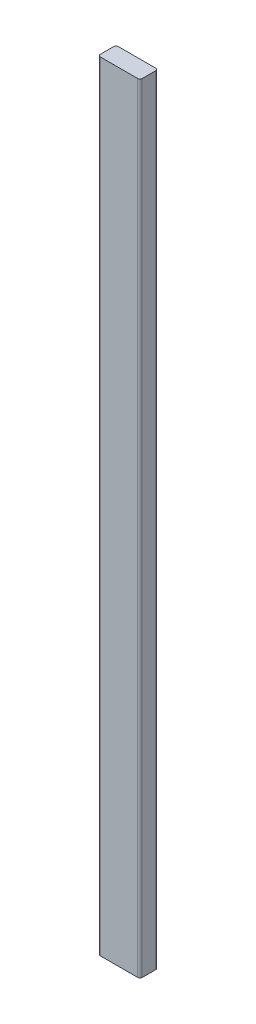
ISO-10303-21;
HEADER;
FILE_DESCRIPTION(('STEP AP214'),'2;1');
FILE_NAME('part.step','',(''),(''),'','','');
FILE_SCHEMA(('AUTOMOTIVE_DESIGN { 1 0 10303 214 1 1 1 1 }'));
ENDSEC;
DATA;
#1=APPLICATION_CONTEXT('core data for automotive mechanical design processes');
#2=APPLICATION_PROTOCOL_DEFINITION('international standard','automotive_design',2000,#1);
#3=PRODUCT_CONTEXT('',#1,'mechanical');
#4=PRODUCT('Part','Part','',(#3));
#5=PRODUCT_RELATED_PRODUCT_CATEGORY('part','',(#4));
#6=PRODUCT_DEFINITION_FORMATION('','',#4);
#7=PRODUCT_DEFINITION_CONTEXT('part definition',#1,'design');
#8=PRODUCT_DEFINITION('design','',#6,#7);
#9=PRODUCT_DEFINITION_SHAPE('','',#8);
#10=(LENGTH_UNIT() NAMED_UNIT(*) SI_UNIT(.MILLI.,.METRE.));
#11=(NAMED_UNIT(*) PLANE_ANGLE_UNIT() SI_UNIT($,.RADIAN.));
#12=(NAMED_UNIT(*) SI_UNIT($,.STERADIAN.) SOLID_ANGLE_UNIT());
#13=UNCERTAINTY_MEASURE_WITH_UNIT(LENGTH_MEASURE(1.E-05),#10,'distance_accuracy_value','');
#14=(GEOMETRIC_REPRESENTATION_CONTEXT(3) GLOBAL_UNCERTAINTY_ASSIGNED_CONTEXT((#13)) GLOBAL_UNIT_ASSIGNED_CONTEXT((#10,
#11,#12)) REPRESENTATION_CONTEXT('',''));
#15=CARTESIAN_POINT('',(0.,0.,0.));
#16=DIRECTION('',(0.,0.,1.));
#17=DIRECTION('',(1.,0.,0.));
#18=AXIS2_PLACEMENT_3D('',#15,#16,#17);
#19=CARTESIAN_POINT('',(-547.832187925,1651.,-1691.49172914346));
#20=DIRECTION('',(-1.,0.,0.));
#21=DIRECTION('',(0.,-1.,0.));
#22=AXIS2_PLACEMENT_3D('',#19,#20,#21);
#23=PLANE('',#22);
#24=DIRECTION('',(0.,0.,1.));
#25=VECTOR('',#24,1.);
#26=CARTESIAN_POINT('',(-547.832187925,1651.,-1691.49172914346));
#27=LINE('',#26,#25);
#28=CARTESIAN_POINT('',(-547.832187925,1651.,-33.3375));
#29=VERTEX_POINT('',#28);
#30=CARTESIAN_POINT('',(-547.832187925,1651.,-4.7625));
#31=VERTEX_POINT('',#30);
#32=EDGE_CURVE('E136',#29,#31,#27,.T.);
#33=ORIENTED_EDGE('',*,*,#32,.F.);
#34=DIRECTION('',(0.,1.,0.));
#35=VECTOR('',#34,1.);
#36=CARTESIAN_POINT('',(-547.832187925,0.,-33.3375));
#37=LINE('',#36,#35);
#38=CARTESIAN_POINT('',(-547.832187925,0.,-33.3375));
#39=VERTEX_POINT('',#38);
#40=EDGE_CURVE('E109',#29,#39,#37,.F.);
#41=ORIENTED_EDGE('',*,*,#40,.T.);
#42=DIRECTION('',(0.,0.,1.));
#43=VECTOR('',#42,1.);
#44=CARTESIAN_POINT('',(-547.832187925,0.,-1691.49172914346));
#45=LINE('',#44,#43);
#46=CARTESIAN_POINT('',(-547.832187925,0.,-4.7625));
#47=VERTEX_POINT('',#46);
#48=EDGE_CURVE('E151',#39,#47,#45,.T.);
#49=ORIENTED_EDGE('',*,*,#48,.T.);
#50=DIRECTION('',(0.,-1.,0.));
#51=VECTOR('',#50,1.);
#52=CARTESIAN_POINT('',(-547.832187925,1651.,-4.7625));
#53=LINE('',#52,#51);
#54=EDGE_CURVE('E115',#47,#31,#53,.F.);
#55=ORIENTED_EDGE('',*,*,#54,.T.);
#56=EDGE_LOOP('',(#33,#41,#49,#55));
#57=FACE_BOUND('',#56,.T.);
#58=ADVANCED_FACE('F36',(#57),#23,.T.);
#59=CARTESIAN_POINT('',(-547.832187925,1651.,-1691.49172914346));
#60=DIRECTION('',(0.,1.,0.));
#61=DIRECTION('',(0.,0.,1.));
#62=AXIS2_PLACEMENT_3D('',#59,#60,#61);
#63=PLANE('',#62);
#64=DIRECTION('',(1.,0.,0.));
#65=VECTOR('',#64,1.);
#66=CARTESIAN_POINT('',(-547.832187925,1651.,-38.1));
#67=LINE('',#66,#65);
#68=CARTESIAN_POINT('',(-543.069687925,1651.,-38.1));
#69=VERTEX_POINT('',#68);
#70=CARTESIAN_POINT('',(-463.694687925,1651.,-38.1));
#71=VERTEX_POINT('',#70);
#72=EDGE_CURVE('E123',#69,#71,#67,.T.);
#73=ORIENTED_EDGE('',*,*,#72,.F.);
#74=CARTESIAN_POINT('',(-543.069687925,1651.,-33.3375));
#75=DIRECTION('',(0.,1.,0.));
#76=DIRECTION('',(0.,0.,1.));
#77=AXIS2_PLACEMENT_3D('',#74,#75,#76);
#78=CIRCLE('',#77,4.7625);
#79=EDGE_CURVE('E104',#69,#29,#78,.T.);
#80=ORIENTED_EDGE('',*,*,#79,.T.);
#81=ORIENTED_EDGE('',*,*,#32,.T.);
#82=CARTESIAN_POINT('',(-543.069687925,1651.,-4.7625));
#83=DIRECTION('',(0.,1.,0.));
#84=DIRECTION('',(0.,0.,1.));
#85=AXIS2_PLACEMENT_3D('',#82,#83,#84);
#86=CIRCLE('',#85,4.7625);
#87=CARTESIAN_POINT('',(-543.069687925,1651.,0.));
#88=VERTEX_POINT('',#87);
#89=EDGE_CURVE('E116',#31,#88,#86,.T.);
#90=ORIENTED_EDGE('',*,*,#89,.T.);
#91=DIRECTION('',(-1.,0.,0.));
#92=VECTOR('',#91,1.);
#93=CARTESIAN_POINT('',(-547.832187925,1651.,0.));
#94=LINE('',#93,#92);
#95=CARTESIAN_POINT('',(-463.694687925,1651.,0.));
#96=VERTEX_POINT('',#95);
#97=EDGE_CURVE('E148',#96,#88,#94,.T.);
#98=ORIENTED_EDGE('',*,*,#97,.F.);
#99=CARTESIAN_POINT('',(-463.694687925,1651.,-4.7625));
#100=DIRECTION('',(0.,1.,0.));
#101=DIRECTION('',(0.,0.,1.));
#102=AXIS2_PLACEMENT_3D('',#99,#100,#101);
#103=CIRCLE('',#102,4.7625);
#104=CARTESIAN_POINT('',(-458.932187925,1651.,-4.7625));
#105=VERTEX_POINT('',#104);
#106=EDGE_CURVE('E128',#96,#105,#103,.T.);
#107=ORIENTED_EDGE('',*,*,#106,.T.);
#108=DIRECTION('',(0.,0.,1.));
#109=VECTOR('',#108,1.);
#110=CARTESIAN_POINT('',(-458.932187925,1651.,-1691.49172914346));
#111=LINE('',#110,#109);
#112=CARTESIAN_POINT('',(-458.932187925,1651.,-33.3375));
#113=VERTEX_POINT('',#112);
#114=EDGE_CURVE('E142',#113,#105,#111,.T.);
#115=ORIENTED_EDGE('',*,*,#114,.F.);
#116=CARTESIAN_POINT('',(-463.694687925,1651.,-33.3375));
#117=DIRECTION('',(0.,1.,0.));
#118=DIRECTION('',(0.,0.,1.));
#119=AXIS2_PLACEMENT_3D('',#116,#117,#118);
#120=CIRCLE('',#119,4.7625);
#121=EDGE_CURVE('E134',#113,#71,#120,.T.);
#122=ORIENTED_EDGE('',*,*,#121,.T.);
#123=EDGE_LOOP('',(#73,#80,#81,#90,#98,#107,#115,#122));
#124=FACE_BOUND('',#123,.T.);
#125=ADVANCED_FACE('F131',(#124),#63,.T.);
#126=CARTESIAN_POINT('',(-458.932187925,1651.,-1691.49172914346));
#127=DIRECTION('',(1.,0.,0.));
#128=DIRECTION('',(0.,1.,0.));
#129=AXIS2_PLACEMENT_3D('',#126,#127,#128);
#130=PLANE('',#129);
#131=DIRECTION('',(0.,0.,1.));
#132=VECTOR('',#131,1.);
#133=CARTESIAN_POINT('',(-458.932187925,0.,-1691.49172914346));
#134=LINE('',#133,#132);
#135=CARTESIAN_POINT('',(-458.932187925,0.,-33.3375));
#136=VERTEX_POINT('',#135);
#137=CARTESIAN_POINT('',(-458.932187925,0.,-4.7625));
#138=VERTEX_POINT('',#137);
#139=EDGE_CURVE('E156',#136,#138,#134,.T.);
#140=ORIENTED_EDGE('',*,*,#139,.F.);
#141=DIRECTION('',(0.,-1.,0.));
#142=VECTOR('',#141,1.);
#143=CARTESIAN_POINT('',(-458.932187925,1651.,-33.3375));
#144=LINE('',#143,#142);
#145=EDGE_CURVE('E11',#136,#113,#144,.F.);
#146=ORIENTED_EDGE('',*,*,#145,.T.);
#147=ORIENTED_EDGE('',*,*,#114,.T.);
#148=DIRECTION('',(0.,1.,0.));
#149=VECTOR('',#148,1.);
#150=CARTESIAN_POINT('',(-458.932187925,1651.,-4.7625));
#151=LINE('',#150,#149);
#152=EDGE_CURVE('E45',#105,#138,#151,.F.);
#153=ORIENTED_EDGE('',*,*,#152,.T.);
#154=EDGE_LOOP('',(#140,#146,#147,#153));
#155=FACE_BOUND('',#154,.T.);
#156=ADVANCED_FACE('F195',(#155),#130,.T.);
#157=CARTESIAN_POINT('',(-547.832187925,0.,-1691.49172914346));
#158=DIRECTION('',(0.,-1.,0.));
#159=DIRECTION('',(0.,0.,-1.));
#160=AXIS2_PLACEMENT_3D('',#157,#158,#159);
#161=PLANE('',#160);
#162=ORIENTED_EDGE('',*,*,#48,.F.);
#163=CARTESIAN_POINT('',(-543.069687925,0.,-33.3375));
#164=DIRECTION('',(0.,-1.,0.));
#165=DIRECTION('',(0.,0.,-1.));
#166=AXIS2_PLACEMENT_3D('',#163,#164,#165);
#167=CIRCLE('',#166,4.7625);
#168=CARTESIAN_POINT('',(-543.069687925,0.,-38.1));
#169=VERTEX_POINT('',#168);
#170=EDGE_CURVE('E181',#39,#169,#167,.T.);
#171=ORIENTED_EDGE('',*,*,#170,.T.);
#172=DIRECTION('',(-1.,0.,0.));
#173=VECTOR('',#172,1.);
#174=CARTESIAN_POINT('',(-547.832187925,0.,-38.1));
#175=LINE('',#174,#173);
#176=CARTESIAN_POINT('',(-463.694687925,0.,-38.1));
#177=VERTEX_POINT('',#176);
#178=EDGE_CURVE('E126',#177,#169,#175,.T.);
#179=ORIENTED_EDGE('',*,*,#178,.F.);
#180=CARTESIAN_POINT('',(-463.694687925,0.,-33.3375));
#181=DIRECTION('',(0.,-1.,0.));
#182=DIRECTION('',(0.,0.,-1.));
#183=AXIS2_PLACEMENT_3D('',#180,#181,#182);
#184=CIRCLE('',#183,4.7625);
#185=EDGE_CURVE('E176',#177,#136,#184,.T.);
#186=ORIENTED_EDGE('',*,*,#185,.T.);
#187=ORIENTED_EDGE('',*,*,#139,.T.);
#188=CARTESIAN_POINT('',(-463.694687925,0.,-4.7625));
#189=DIRECTION('',(0.,-1.,0.));
#190=DIRECTION('',(0.,0.,-1.));
#191=AXIS2_PLACEMENT_3D('',#188,#189,#190);
#192=CIRCLE('',#191,4.7625);
#193=CARTESIAN_POINT('',(-463.694687925,0.,0.));
#194=VERTEX_POINT('',#193);
#195=EDGE_CURVE('E52',#138,#194,#192,.T.);
#196=ORIENTED_EDGE('',*,*,#195,.T.);
#197=DIRECTION('',(1.,0.,0.));
#198=VECTOR('',#197,1.);
#199=CARTESIAN_POINT('',(-547.832187925,0.,0.));
#200=LINE('',#199,#198);
#201=CARTESIAN_POINT('',(-543.069687925,0.,0.));
#202=VERTEX_POINT('',#201);
#203=EDGE_CURVE('E145',#202,#194,#200,.T.);
#204=ORIENTED_EDGE('',*,*,#203,.F.);
#205=CARTESIAN_POINT('',(-543.069687925,0.,-4.7625));
#206=DIRECTION('',(0.,-1.,0.));
#207=DIRECTION('',(0.,0.,-1.));
#208=AXIS2_PLACEMENT_3D('',#205,#206,#207);
#209=CIRCLE('',#208,4.7625);
#210=EDGE_CURVE('E60',#202,#47,#209,.T.);
#211=ORIENTED_EDGE('',*,*,#210,.T.);
#212=EDGE_LOOP('',(#162,#171,#179,#186,#187,#196,#204,#211));
#213=FACE_BOUND('',#212,.T.);
#214=ADVANCED_FACE('F199',(#213),#161,.T.);
#215=CARTESIAN_POINT('',(0.,0.,0.));
#216=DIRECTION('',(0.,0.,1.));
#217=DIRECTION('',(1.,0.,0.));
#218=AXIS2_PLACEMENT_3D('',#215,#216,#217);
#219=PLANE('',#218);
#220=ORIENTED_EDGE('',*,*,#97,.T.);
#221=DIRECTION('',(0.,-1.,0.));
#222=VECTOR('',#221,1.);
#223=CARTESIAN_POINT('',(-543.069687925,0.,0.));
#224=LINE('',#223,#222);
#225=EDGE_CURVE('E188',#88,#202,#224,.T.);
#226=ORIENTED_EDGE('',*,*,#225,.T.);
#227=ORIENTED_EDGE('',*,*,#203,.T.);
#228=DIRECTION('',(0.,1.,0.));
#229=VECTOR('',#228,1.);
#230=CARTESIAN_POINT('',(-463.694687925,0.,0.));
#231=LINE('',#230,#229);
#232=EDGE_CURVE('E184',#194,#96,#231,.T.);
#233=ORIENTED_EDGE('',*,*,#232,.T.);
#234=EDGE_LOOP('',(#220,#226,#227,#233));
#235=FACE_BOUND('',#234,.T.);
#236=ADVANCED_FACE('F203',(#235),#219,.T.);
#237=CARTESIAN_POINT('',(-458.932187925,1612.9,-38.1));
#238=DIRECTION('',(0.,0.,1.));
#239=DIRECTION('',(0.,1.,0.));
#240=AXIS2_PLACEMENT_3D('',#237,#238,#239);
#241=PLANE('',#240);
#242=ORIENTED_EDGE('',*,*,#178,.T.);
#243=DIRECTION('',(0.,1.,0.));
#244=VECTOR('',#243,1.);
#245=CARTESIAN_POINT('',(-543.069687925,1651.,-38.1));
#246=LINE('',#245,#244);
#247=EDGE_CURVE('E108',#169,#69,#246,.T.);
#248=ORIENTED_EDGE('',*,*,#247,.T.);
#249=ORIENTED_EDGE('',*,*,#72,.T.);
#250=DIRECTION('',(0.,-1.,0.));
#251=VECTOR('',#250,1.);
#252=CARTESIAN_POINT('',(-463.694687925,0.,-38.1));
#253=LINE('',#252,#251);
#254=EDGE_CURVE('E129',#71,#177,#253,.T.);
#255=ORIENTED_EDGE('',*,*,#254,.T.);
#256=EDGE_LOOP('',(#242,#248,#249,#255));
#257=FACE_BOUND('',#256,.T.);
#258=ADVANCED_FACE('F121',(#257),#241,.F.);
#259=CARTESIAN_POINT('',(-543.069687925,1612.9,-33.3375));
#260=DIRECTION('',(0.,-1.,0.));
#261=DIRECTION('',(1.,0.,0.));
#262=AXIS2_PLACEMENT_3D('',#259,#260,#261);
#263=CYLINDRICAL_SURFACE('',#262,4.7625);
#264=ORIENTED_EDGE('',*,*,#170,.F.);
#265=ORIENTED_EDGE('',*,*,#40,.F.);
#266=ORIENTED_EDGE('',*,*,#79,.F.);
#267=ORIENTED_EDGE('',*,*,#247,.F.);
#268=EDGE_LOOP('',(#264,#265,#266,#267));
#269=FACE_BOUND('',#268,.T.);
#270=ADVANCED_FACE('F107',(#269),#263,.T.);
#271=CARTESIAN_POINT('',(-543.069687925,0.,-4.7625));
#272=DIRECTION('',(0.,-1.,0.));
#273=DIRECTION('',(1.,0.,0.));
#274=AXIS2_PLACEMENT_3D('',#271,#272,#273);
#275=CYLINDRICAL_SURFACE('',#274,4.7625);
#276=ORIENTED_EDGE('',*,*,#89,.F.);
#277=ORIENTED_EDGE('',*,*,#54,.F.);
#278=ORIENTED_EDGE('',*,*,#210,.F.);
#279=ORIENTED_EDGE('',*,*,#225,.F.);
#280=EDGE_LOOP('',(#276,#277,#278,#279));
#281=FACE_BOUND('',#280,.T.);
#282=ADVANCED_FACE('F205',(#281),#275,.T.);
#283=CARTESIAN_POINT('',(-463.694687925,1612.9,-33.3375));
#284=DIRECTION('',(0.,1.,0.));
#285=DIRECTION('',(-1.,0.,0.));
#286=AXIS2_PLACEMENT_3D('',#283,#284,#285);
#287=CYLINDRICAL_SURFACE('',#286,4.7625);
#288=ORIENTED_EDGE('',*,*,#121,.F.);
#289=ORIENTED_EDGE('',*,*,#145,.F.);
#290=ORIENTED_EDGE('',*,*,#185,.F.);
#291=ORIENTED_EDGE('',*,*,#254,.F.);
#292=EDGE_LOOP('',(#288,#289,#290,#291));
#293=FACE_BOUND('',#292,.T.);
#294=ADVANCED_FACE('F219',(#293),#287,.T.);
#295=CARTESIAN_POINT('',(-463.694687925,0.,-4.7625));
#296=DIRECTION('',(0.,1.,0.));
#297=DIRECTION('',(-1.,0.,0.));
#298=AXIS2_PLACEMENT_3D('',#295,#296,#297);
#299=CYLINDRICAL_SURFACE('',#298,4.7625);
#300=ORIENTED_EDGE('',*,*,#195,.F.);
#301=ORIENTED_EDGE('',*,*,#152,.F.);
#302=ORIENTED_EDGE('',*,*,#106,.F.);
#303=ORIENTED_EDGE('',*,*,#232,.F.);
#304=EDGE_LOOP('',(#300,#301,#302,#303));
#305=FACE_BOUND('',#304,.T.);
#306=ADVANCED_FACE('F38',(#305),#299,.T.);
#307=CLOSED_SHELL('',(#58,#125,#156,#214,#236,#258,#270,#282,#294,#306));
#308=MANIFOLD_SOLID_BREP('B2',#307);
#309=ADVANCED_BREP_SHAPE_REPRESENTATION('',(#18,#308),#14);
#310=SHAPE_DEFINITION_REPRESENTATION(#9,#309);
ENDSEC;
END-ISO-10303-21;
